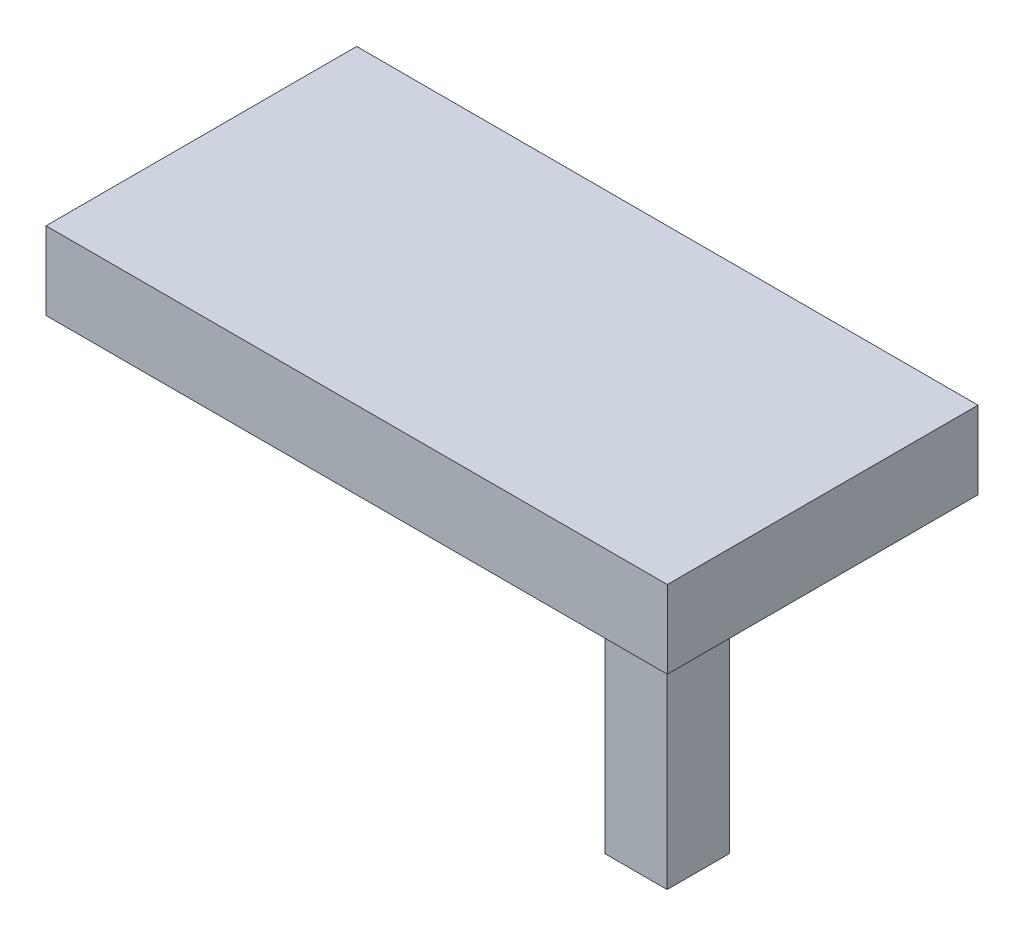
ISO-10303-21;
HEADER;
FILE_DESCRIPTION(('STEP AP214'),'2;1');
FILE_NAME('part.step','',(''),(''),'','','');
FILE_SCHEMA(('AUTOMOTIVE_DESIGN { 1 0 10303 214 1 1 1 1 }'));
ENDSEC;
DATA;
#1=APPLICATION_CONTEXT('core data for automotive mechanical design processes');
#2=APPLICATION_PROTOCOL_DEFINITION('international standard','automotive_design',2000,#1);
#3=PRODUCT_CONTEXT('',#1,'mechanical');
#4=PRODUCT('Part','Part','',(#3));
#5=PRODUCT_RELATED_PRODUCT_CATEGORY('part','',(#4));
#6=PRODUCT_DEFINITION_FORMATION('','',#4);
#7=PRODUCT_DEFINITION_CONTEXT('part definition',#1,'design');
#8=PRODUCT_DEFINITION('design','',#6,#7);
#9=PRODUCT_DEFINITION_SHAPE('','',#8);
#10=(LENGTH_UNIT() NAMED_UNIT(*) SI_UNIT(.MILLI.,.METRE.));
#11=(NAMED_UNIT(*) PLANE_ANGLE_UNIT() SI_UNIT($,.RADIAN.));
#12=(NAMED_UNIT(*) SI_UNIT($,.STERADIAN.) SOLID_ANGLE_UNIT());
#13=UNCERTAINTY_MEASURE_WITH_UNIT(LENGTH_MEASURE(1.E-05),#10,'distance_accuracy_value','');
#14=(GEOMETRIC_REPRESENTATION_CONTEXT(3) GLOBAL_UNCERTAINTY_ASSIGNED_CONTEXT((#13)) GLOBAL_UNIT_ASSIGNED_CONTEXT((#10,
#11,#12)) REPRESENTATION_CONTEXT('',''));
#15=CARTESIAN_POINT('',(0.,0.,0.));
#16=DIRECTION('',(0.,0.,1.));
#17=DIRECTION('',(1.,0.,0.));
#18=AXIS2_PLACEMENT_3D('',#15,#16,#17);
#19=CARTESIAN_POINT('',(0.,-100.,0.));
#20=DIRECTION('',(0.,-1.,0.));
#21=DIRECTION('',(0.,0.,-1.));
#22=AXIS2_PLACEMENT_3D('',#19,#20,#21);
#23=PLANE('',#22);
#24=DIRECTION('',(0.,0.,1.));
#25=VECTOR('',#24,1.);
#26=CARTESIAN_POINT('',(750.,-100.,251.580834492202));
#27=LINE('',#26,#25);
#28=CARTESIAN_POINT('',(750.,-100.,-251.580834492202));
#29=VERTEX_POINT('',#28);
#30=CARTESIAN_POINT('',(750.,-100.,251.580834492202));
#31=VERTEX_POINT('',#30);
#32=EDGE_CURVE('E183',#29,#31,#27,.T.);
#33=ORIENTED_EDGE('',*,*,#32,.T.);
#34=DIRECTION('',(-1.,0.,0.));
#35=VECTOR('',#34,1.);
#36=CARTESIAN_POINT('',(250.,-100.,251.580834492202));
#37=LINE('',#36,#35);
#38=CARTESIAN_POINT('',(250.,-100.,251.580834492202));
#39=VERTEX_POINT('',#38);
#40=EDGE_CURVE('E186',#31,#39,#37,.T.);
#41=ORIENTED_EDGE('',*,*,#40,.T.);
#42=DIRECTION('',(0.,0.,-1.));
#43=VECTOR('',#42,1.);
#44=CARTESIAN_POINT('',(250.,-100.,251.580834492202));
#45=LINE('',#44,#43);
#46=CARTESIAN_POINT('',(250.,-100.,-251.580834492202));
#47=VERTEX_POINT('',#46);
#48=EDGE_CURVE('E189',#39,#47,#45,.T.);
#49=ORIENTED_EDGE('',*,*,#48,.T.);
#50=DIRECTION('',(1.,0.,0.));
#51=VECTOR('',#50,1.);
#52=CARTESIAN_POINT('',(250.,-100.,-251.580834492202));
#53=LINE('',#52,#51);
#54=EDGE_CURVE('E191',#47,#29,#53,.T.);
#55=ORIENTED_EDGE('',*,*,#54,.T.);
#56=EDGE_LOOP('',(#33,#41,#49,#55));
#57=FACE_BOUND('',#56,.T.);
#58=DIRECTION('',(0.,0.,1.));
#59=VECTOR('',#58,1.);
#60=CARTESIAN_POINT('',(600.,-100.,-100.632333796881));
#61=LINE('',#60,#59);
#62=CARTESIAN_POINT('',(600.,-100.,-100.632333796881));
#63=VERTEX_POINT('',#62);
#64=CARTESIAN_POINT('',(600.,-100.,100.632333796881));
#65=VERTEX_POINT('',#64);
#66=EDGE_CURVE('E165',#63,#65,#61,.T.);
#67=ORIENTED_EDGE('',*,*,#66,.F.);
#68=DIRECTION('',(-1.,0.,0.));
#69=VECTOR('',#68,1.);
#70=CARTESIAN_POINT('',(600.,-100.,-100.632333796881));
#71=LINE('',#70,#69);
#72=CARTESIAN_POINT('',(400.,-100.,-100.632333796881));
#73=VERTEX_POINT('',#72);
#74=EDGE_CURVE('E48',#63,#73,#71,.T.);
#75=ORIENTED_EDGE('',*,*,#74,.T.);
#76=DIRECTION('',(0.,0.,1.));
#77=VECTOR('',#76,1.);
#78=CARTESIAN_POINT('',(400.,-100.,-100.632333796881));
#79=LINE('',#78,#77);
#80=CARTESIAN_POINT('',(400.,-100.,100.632333796881));
#81=VERTEX_POINT('',#80);
#82=EDGE_CURVE('E53',#73,#81,#79,.T.);
#83=ORIENTED_EDGE('',*,*,#82,.T.);
#84=DIRECTION('',(-1.,0.,0.));
#85=VECTOR('',#84,1.);
#86=CARTESIAN_POINT('',(600.,-100.,100.632333796881));
#87=LINE('',#86,#85);
#88=EDGE_CURVE('E168',#65,#81,#87,.T.);
#89=ORIENTED_EDGE('',*,*,#88,.F.);
#90=EDGE_LOOP('',(#67,#75,#83,#89));
#91=FACE_BOUND('',#90,.T.);
#92=ADVANCED_FACE('F33',(#57,#91),#23,.T.);
#93=CARTESIAN_POINT('',(0.,0.,0.));
#94=DIRECTION('',(0.,1.,0.));
#95=DIRECTION('',(0.,0.,1.));
#96=AXIS2_PLACEMENT_3D('',#93,#94,#95);
#97=PLANE('',#96);
#98=DIRECTION('',(0.,0.,-1.));
#99=VECTOR('',#98,1.);
#100=CARTESIAN_POINT('',(-750.,0.,-251.580834492202));
#101=LINE('',#100,#99);
#102=CARTESIAN_POINT('',(-750.,0.,251.580834492202));
#103=VERTEX_POINT('',#102);
#104=CARTESIAN_POINT('',(-750.,0.,-251.580834492202));
#105=VERTEX_POINT('',#104);
#106=EDGE_CURVE('E215',#103,#105,#101,.T.);
#107=ORIENTED_EDGE('',*,*,#106,.F.);
#108=DIRECTION('',(-1.,0.,0.));
#109=VECTOR('',#108,1.);
#110=CARTESIAN_POINT('',(-250.,0.,251.580834492202));
#111=LINE('',#110,#109);
#112=CARTESIAN_POINT('',(-250.,0.,251.580834492202));
#113=VERTEX_POINT('',#112);
#114=EDGE_CURVE('E220',#113,#103,#111,.T.);
#115=ORIENTED_EDGE('',*,*,#114,.F.);
#116=DIRECTION('',(0.,0.,1.));
#117=VECTOR('',#116,1.);
#118=CARTESIAN_POINT('',(-250.,0.,-251.580834492202));
#119=LINE('',#118,#117);
#120=CARTESIAN_POINT('',(-250.,0.,-251.580834492202));
#121=VERTEX_POINT('',#120);
#122=EDGE_CURVE('E232',#121,#113,#119,.T.);
#123=ORIENTED_EDGE('',*,*,#122,.F.);
#124=DIRECTION('',(1.,0.,0.));
#125=VECTOR('',#124,1.);
#126=CARTESIAN_POINT('',(-250.,0.,-251.580834492202));
#127=LINE('',#126,#125);
#128=EDGE_CURVE('E229',#105,#121,#127,.T.);
#129=ORIENTED_EDGE('',*,*,#128,.F.);
#130=EDGE_LOOP('',(#107,#115,#123,#129));
#131=FACE_BOUND('',#130,.T.);
#132=DIRECTION('',(0.,0.,-1.));
#133=VECTOR('',#132,1.);
#134=CARTESIAN_POINT('',(1000.,0.,-500.));
#135=LINE('',#134,#133);
#136=CARTESIAN_POINT('',(1000.,0.,500.));
#137=VERTEX_POINT('',#136);
#138=CARTESIAN_POINT('',(1000.,0.,-500.));
#139=VERTEX_POINT('',#138);
#140=EDGE_CURVE('E248',#137,#139,#135,.T.);
#141=ORIENTED_EDGE('',*,*,#140,.F.);
#142=DIRECTION('',(1.,0.,0.));
#143=VECTOR('',#142,1.);
#144=CARTESIAN_POINT('',(-1000.,0.,500.));
#145=LINE('',#144,#143);
#146=CARTESIAN_POINT('',(-1000.,0.,500.));
#147=VERTEX_POINT('',#146);
#148=EDGE_CURVE('E253',#147,#137,#145,.T.);
#149=ORIENTED_EDGE('',*,*,#148,.F.);
#150=DIRECTION('',(0.,0.,1.));
#151=VECTOR('',#150,1.);
#152=CARTESIAN_POINT('',(-1000.,0.,-500.));
#153=LINE('',#152,#151);
#154=CARTESIAN_POINT('',(-1000.,0.,-500.));
#155=VERTEX_POINT('',#154);
#156=EDGE_CURVE('E264',#155,#147,#153,.T.);
#157=ORIENTED_EDGE('',*,*,#156,.F.);
#158=DIRECTION('',(-1.,0.,0.));
#159=VECTOR('',#158,1.);
#160=CARTESIAN_POINT('',(-1000.,0.,-500.));
#161=LINE('',#160,#159);
#162=EDGE_CURVE('E262',#139,#155,#161,.T.);
#163=ORIENTED_EDGE('',*,*,#162,.F.);
#164=EDGE_LOOP('',(#141,#149,#157,#163));
#165=FACE_BOUND('',#164,.T.);
#166=DIRECTION('',(0.,0.,1.));
#167=VECTOR('',#166,1.);
#168=CARTESIAN_POINT('',(750.,0.,251.580834492202));
#169=LINE('',#168,#167);
#170=CARTESIAN_POINT('',(750.,0.,-251.580834492202));
#171=VERTEX_POINT('',#170);
#172=CARTESIAN_POINT('',(750.,0.,251.580834492202));
#173=VERTEX_POINT('',#172);
#174=EDGE_CURVE('E178',#171,#173,#169,.T.);
#175=ORIENTED_EDGE('',*,*,#174,.F.);
#176=DIRECTION('',(1.,0.,0.));
#177=VECTOR('',#176,1.);
#178=CARTESIAN_POINT('',(250.,0.,-251.580834492202));
#179=LINE('',#178,#177);
#180=CARTESIAN_POINT('',(250.,0.,-251.580834492202));
#181=VERTEX_POINT('',#180);
#182=EDGE_CURVE('E187',#181,#171,#179,.T.);
#183=ORIENTED_EDGE('',*,*,#182,.F.);
#184=DIRECTION('',(0.,0.,-1.));
#185=VECTOR('',#184,1.);
#186=CARTESIAN_POINT('',(250.,0.,251.580834492202));
#187=LINE('',#186,#185);
#188=CARTESIAN_POINT('',(250.,0.,251.580834492202));
#189=VERTEX_POINT('',#188);
#190=EDGE_CURVE('E199',#189,#181,#187,.T.);
#191=ORIENTED_EDGE('',*,*,#190,.F.);
#192=DIRECTION('',(-1.,0.,0.));
#193=VECTOR('',#192,1.);
#194=CARTESIAN_POINT('',(250.,0.,251.580834492202));
#195=LINE('',#194,#193);
#196=EDGE_CURVE('E196',#173,#189,#195,.T.);
#197=ORIENTED_EDGE('',*,*,#196,.F.);
#198=EDGE_LOOP('',(#175,#183,#191,#197));
#199=FACE_BOUND('',#198,.T.);
#200=ADVANCED_FACE('F282',(#131,#165,#199),#97,.F.);
#201=CARTESIAN_POINT('',(1000.,250.,-500.));
#202=DIRECTION('',(-1.,0.,0.));
#203=DIRECTION('',(0.,0.,1.));
#204=AXIS2_PLACEMENT_3D('',#201,#202,#203);
#205=PLANE('',#204);
#206=ORIENTED_EDGE('',*,*,#140,.T.);
#207=DIRECTION('',(0.,-1.,0.));
#208=VECTOR('',#207,1.);
#209=CARTESIAN_POINT('',(1000.,250.,-500.));
#210=LINE('',#209,#208);
#211=CARTESIAN_POINT('',(1000.,250.,-500.));
#212=VERTEX_POINT('',#211);
#213=EDGE_CURVE('E11',#212,#139,#210,.T.);
#214=ORIENTED_EDGE('',*,*,#213,.F.);
#215=DIRECTION('',(0.,0.,-1.));
#216=VECTOR('',#215,1.);
#217=CARTESIAN_POINT('',(1000.,250.,-500.));
#218=LINE('',#217,#216);
#219=CARTESIAN_POINT('',(1000.,250.,500.));
#220=VERTEX_POINT('',#219);
#221=EDGE_CURVE('E249',#220,#212,#218,.T.);
#222=ORIENTED_EDGE('',*,*,#221,.F.);
#223=DIRECTION('',(0.,-1.,0.));
#224=VECTOR('',#223,1.);
#225=CARTESIAN_POINT('',(1000.,250.,500.));
#226=LINE('',#225,#224);
#227=EDGE_CURVE('E259',#220,#137,#226,.T.);
#228=ORIENTED_EDGE('',*,*,#227,.T.);
#229=EDGE_LOOP('',(#206,#214,#222,#228));
#230=FACE_BOUND('',#229,.T.);
#231=ADVANCED_FACE('F35',(#230),#205,.F.);
#232=CARTESIAN_POINT('',(-1000.,250.,-500.));
#233=DIRECTION('',(0.,0.,1.));
#234=DIRECTION('',(1.,0.,0.));
#235=AXIS2_PLACEMENT_3D('',#232,#233,#234);
#236=PLANE('',#235);
#237=ORIENTED_EDGE('',*,*,#162,.T.);
#238=DIRECTION('',(0.,-1.,0.));
#239=VECTOR('',#238,1.);
#240=CARTESIAN_POINT('',(-1000.,250.,-500.));
#241=LINE('',#240,#239);
#242=CARTESIAN_POINT('',(-1000.,250.,-500.));
#243=VERTEX_POINT('',#242);
#244=EDGE_CURVE('E41',#243,#155,#241,.T.);
#245=ORIENTED_EDGE('',*,*,#244,.F.);
#246=DIRECTION('',(-1.,0.,0.));
#247=VECTOR('',#246,1.);
#248=CARTESIAN_POINT('',(-1000.,250.,-500.));
#249=LINE('',#248,#247);
#250=EDGE_CURVE('E252',#212,#243,#249,.T.);
#251=ORIENTED_EDGE('',*,*,#250,.F.);
#252=ORIENTED_EDGE('',*,*,#213,.T.);
#253=EDGE_LOOP('',(#237,#245,#251,#252));
#254=FACE_BOUND('',#253,.T.);
#255=ADVANCED_FACE('F293',(#254),#236,.F.);
#256=CARTESIAN_POINT('',(-1000.,250.,-500.));
#257=DIRECTION('',(1.,0.,0.));
#258=DIRECTION('',(0.,0.,-1.));
#259=AXIS2_PLACEMENT_3D('',#256,#257,#258);
#260=PLANE('',#259);
#261=ORIENTED_EDGE('',*,*,#156,.T.);
#262=DIRECTION('',(0.,-1.,0.));
#263=VECTOR('',#262,1.);
#264=CARTESIAN_POINT('',(-1000.,250.,500.));
#265=LINE('',#264,#263);
#266=CARTESIAN_POINT('',(-1000.,250.,500.));
#267=VERTEX_POINT('',#266);
#268=EDGE_CURVE('E269',#267,#147,#265,.T.);
#269=ORIENTED_EDGE('',*,*,#268,.F.);
#270=DIRECTION('',(0.,0.,1.));
#271=VECTOR('',#270,1.);
#272=CARTESIAN_POINT('',(-1000.,250.,-500.));
#273=LINE('',#272,#271);
#274=EDGE_CURVE('E255',#243,#267,#273,.T.);
#275=ORIENTED_EDGE('',*,*,#274,.F.);
#276=ORIENTED_EDGE('',*,*,#244,.T.);
#277=EDGE_LOOP('',(#261,#269,#275,#276));
#278=FACE_BOUND('',#277,.T.);
#279=ADVANCED_FACE('F276',(#278),#260,.F.);
#280=CARTESIAN_POINT('',(-1000.,250.,500.));
#281=DIRECTION('',(0.,0.,-1.));
#282=DIRECTION('',(-1.,0.,0.));
#283=AXIS2_PLACEMENT_3D('',#280,#281,#282);
#284=PLANE('',#283);
#285=ORIENTED_EDGE('',*,*,#148,.T.);
#286=ORIENTED_EDGE('',*,*,#227,.F.);
#287=DIRECTION('',(1.,0.,0.));
#288=VECTOR('',#287,1.);
#289=CARTESIAN_POINT('',(-1000.,250.,500.));
#290=LINE('',#289,#288);
#291=EDGE_CURVE('E257',#267,#220,#290,.T.);
#292=ORIENTED_EDGE('',*,*,#291,.F.);
#293=ORIENTED_EDGE('',*,*,#268,.T.);
#294=EDGE_LOOP('',(#285,#286,#292,#293));
#295=FACE_BOUND('',#294,.T.);
#296=ADVANCED_FACE('F286',(#295),#284,.F.);
#297=CARTESIAN_POINT('',(0.,250.,0.));
#298=DIRECTION('',(0.,1.,0.));
#299=DIRECTION('',(0.,0.,1.));
#300=AXIS2_PLACEMENT_3D('',#297,#298,#299);
#301=PLANE('',#300);
#302=ORIENTED_EDGE('',*,*,#221,.T.);
#303=ORIENTED_EDGE('',*,*,#250,.T.);
#304=ORIENTED_EDGE('',*,*,#274,.T.);
#305=ORIENTED_EDGE('',*,*,#291,.T.);
#306=EDGE_LOOP('',(#302,#303,#304,#305));
#307=FACE_BOUND('',#306,.T.);
#308=ADVANCED_FACE('F292',(#307),#301,.T.);
#309=CARTESIAN_POINT('',(-750.,-100.,-251.580834492202));
#310=DIRECTION('',(1.,0.,0.));
#311=DIRECTION('',(0.,0.,-1.));
#312=AXIS2_PLACEMENT_3D('',#309,#310,#311);
#313=PLANE('',#312);
#314=ORIENTED_EDGE('',*,*,#106,.T.);
#315=DIRECTION('',(0.,1.,0.));
#316=VECTOR('',#315,1.);
#317=CARTESIAN_POINT('',(-750.,-100.,-251.580834492202));
#318=LINE('',#317,#316);
#319=CARTESIAN_POINT('',(-750.,-100.,-251.580834492202));
#320=VERTEX_POINT('',#319);
#321=EDGE_CURVE('E245',#320,#105,#318,.T.);
#322=ORIENTED_EDGE('',*,*,#321,.F.);
#323=DIRECTION('',(0.,0.,-1.));
#324=VECTOR('',#323,1.);
#325=CARTESIAN_POINT('',(-750.,-100.,-251.580834492202));
#326=LINE('',#325,#324);
#327=CARTESIAN_POINT('',(-750.,-100.,251.580834492202));
#328=VERTEX_POINT('',#327);
#329=EDGE_CURVE('E216',#328,#320,#326,.T.);
#330=ORIENTED_EDGE('',*,*,#329,.F.);
#331=DIRECTION('',(0.,1.,0.));
#332=VECTOR('',#331,1.);
#333=CARTESIAN_POINT('',(-750.,-100.,251.580834492202));
#334=LINE('',#333,#332);
#335=EDGE_CURVE('E226',#328,#103,#334,.T.);
#336=ORIENTED_EDGE('',*,*,#335,.T.);
#337=EDGE_LOOP('',(#314,#322,#330,#336));
#338=FACE_BOUND('',#337,.T.);
#339=ADVANCED_FACE('F342',(#338),#313,.F.);
#340=CARTESIAN_POINT('',(-250.,-100.,-251.580834492202));
#341=DIRECTION('',(0.,0.,1.));
#342=DIRECTION('',(1.,0.,0.));
#343=AXIS2_PLACEMENT_3D('',#340,#341,#342);
#344=PLANE('',#343);
#345=ORIENTED_EDGE('',*,*,#128,.T.);
#346=DIRECTION('',(0.,1.,0.));
#347=VECTOR('',#346,1.);
#348=CARTESIAN_POINT('',(-250.,-100.,-251.580834492202));
#349=LINE('',#348,#347);
#350=CARTESIAN_POINT('',(-250.,-100.,-251.580834492202));
#351=VERTEX_POINT('',#350);
#352=EDGE_CURVE('E242',#351,#121,#349,.T.);
#353=ORIENTED_EDGE('',*,*,#352,.F.);
#354=DIRECTION('',(1.,0.,0.));
#355=VECTOR('',#354,1.);
#356=CARTESIAN_POINT('',(-250.,-100.,-251.580834492202));
#357=LINE('',#356,#355);
#358=EDGE_CURVE('E219',#320,#351,#357,.T.);
#359=ORIENTED_EDGE('',*,*,#358,.F.);
#360=ORIENTED_EDGE('',*,*,#321,.T.);
#361=EDGE_LOOP('',(#345,#353,#359,#360));
#362=FACE_BOUND('',#361,.T.);
#363=ADVANCED_FACE('F338',(#362),#344,.F.);
#364=CARTESIAN_POINT('',(-250.,-100.,-251.580834492202));
#365=DIRECTION('',(-1.,0.,0.));
#366=DIRECTION('',(0.,0.,1.));
#367=AXIS2_PLACEMENT_3D('',#364,#365,#366);
#368=PLANE('',#367);
#369=ORIENTED_EDGE('',*,*,#122,.T.);
#370=DIRECTION('',(0.,1.,0.));
#371=VECTOR('',#370,1.);
#372=CARTESIAN_POINT('',(-250.,-100.,251.580834492202));
#373=LINE('',#372,#371);
#374=CARTESIAN_POINT('',(-250.,-100.,251.580834492202));
#375=VERTEX_POINT('',#374);
#376=EDGE_CURVE('E239',#375,#113,#373,.T.);
#377=ORIENTED_EDGE('',*,*,#376,.F.);
#378=DIRECTION('',(0.,0.,1.));
#379=VECTOR('',#378,1.);
#380=CARTESIAN_POINT('',(-250.,-100.,-251.580834492202));
#381=LINE('',#380,#379);
#382=EDGE_CURVE('E222',#351,#375,#381,.T.);
#383=ORIENTED_EDGE('',*,*,#382,.F.);
#384=ORIENTED_EDGE('',*,*,#352,.T.);
#385=EDGE_LOOP('',(#369,#377,#383,#384));
#386=FACE_BOUND('',#385,.T.);
#387=ADVANCED_FACE('F334',(#386),#368,.F.);
#388=CARTESIAN_POINT('',(-250.,-100.,251.580834492202));
#389=DIRECTION('',(0.,0.,-1.));
#390=DIRECTION('',(-1.,0.,0.));
#391=AXIS2_PLACEMENT_3D('',#388,#389,#390);
#392=PLANE('',#391);
#393=ORIENTED_EDGE('',*,*,#114,.T.);
#394=ORIENTED_EDGE('',*,*,#335,.F.);
#395=DIRECTION('',(-1.,0.,0.));
#396=VECTOR('',#395,1.);
#397=CARTESIAN_POINT('',(-250.,-100.,251.580834492202));
#398=LINE('',#397,#396);
#399=EDGE_CURVE('E224',#375,#328,#398,.T.);
#400=ORIENTED_EDGE('',*,*,#399,.F.);
#401=ORIENTED_EDGE('',*,*,#376,.T.);
#402=EDGE_LOOP('',(#393,#394,#400,#401));
#403=FACE_BOUND('',#402,.T.);
#404=ADVANCED_FACE('F330',(#403),#392,.F.);
#405=CARTESIAN_POINT('',(0.,-100.,0.));
#406=DIRECTION('',(0.,-1.,0.));
#407=DIRECTION('',(0.,0.,-1.));
#408=AXIS2_PLACEMENT_3D('',#405,#406,#407);
#409=PLANE('',#408);
#410=ORIENTED_EDGE('',*,*,#329,.T.);
#411=ORIENTED_EDGE('',*,*,#358,.T.);
#412=ORIENTED_EDGE('',*,*,#382,.T.);
#413=ORIENTED_EDGE('',*,*,#399,.T.);
#414=EDGE_LOOP('',(#410,#411,#412,#413));
#415=FACE_BOUND('',#414,.T.);
#416=ADVANCED_FACE('F326',(#415),#409,.T.);
#417=CARTESIAN_POINT('',(750.,-100.,251.580834492202));
#418=DIRECTION('',(-1.,0.,0.));
#419=DIRECTION('',(0.,0.,1.));
#420=AXIS2_PLACEMENT_3D('',#417,#418,#419);
#421=PLANE('',#420);
#422=ORIENTED_EDGE('',*,*,#174,.T.);
#423=DIRECTION('',(0.,1.,0.));
#424=VECTOR('',#423,1.);
#425=CARTESIAN_POINT('',(750.,-100.,251.580834492202));
#426=LINE('',#425,#424);
#427=EDGE_CURVE('E212',#31,#173,#426,.T.);
#428=ORIENTED_EDGE('',*,*,#427,.F.);
#429=ORIENTED_EDGE('',*,*,#32,.F.);
#430=DIRECTION('',(0.,1.,0.));
#431=VECTOR('',#430,1.);
#432=CARTESIAN_POINT('',(750.,-100.,-251.580834492202));
#433=LINE('',#432,#431);
#434=EDGE_CURVE('E193',#29,#171,#433,.T.);
#435=ORIENTED_EDGE('',*,*,#434,.T.);
#436=EDGE_LOOP('',(#422,#428,#429,#435));
#437=FACE_BOUND('',#436,.T.);
#438=ADVANCED_FACE('F322',(#437),#421,.F.);
#439=CARTESIAN_POINT('',(250.,-100.,251.580834492202));
#440=DIRECTION('',(0.,0.,-1.));
#441=DIRECTION('',(-1.,0.,0.));
#442=AXIS2_PLACEMENT_3D('',#439,#440,#441);
#443=PLANE('',#442);
#444=ORIENTED_EDGE('',*,*,#196,.T.);
#445=DIRECTION('',(0.,1.,0.));
#446=VECTOR('',#445,1.);
#447=CARTESIAN_POINT('',(250.,-100.,251.580834492202));
#448=LINE('',#447,#446);
#449=EDGE_CURVE('E209',#39,#189,#448,.T.);
#450=ORIENTED_EDGE('',*,*,#449,.F.);
#451=ORIENTED_EDGE('',*,*,#40,.F.);
#452=ORIENTED_EDGE('',*,*,#427,.T.);
#453=EDGE_LOOP('',(#444,#450,#451,#452));
#454=FACE_BOUND('',#453,.T.);
#455=ADVANCED_FACE('F318',(#454),#443,.F.);
#456=CARTESIAN_POINT('',(250.,-100.,251.580834492202));
#457=DIRECTION('',(1.,0.,0.));
#458=DIRECTION('',(0.,0.,-1.));
#459=AXIS2_PLACEMENT_3D('',#456,#457,#458);
#460=PLANE('',#459);
#461=ORIENTED_EDGE('',*,*,#190,.T.);
#462=DIRECTION('',(0.,1.,0.));
#463=VECTOR('',#462,1.);
#464=CARTESIAN_POINT('',(250.,-100.,-251.580834492202));
#465=LINE('',#464,#463);
#466=EDGE_CURVE('E206',#47,#181,#465,.T.);
#467=ORIENTED_EDGE('',*,*,#466,.F.);
#468=ORIENTED_EDGE('',*,*,#48,.F.);
#469=ORIENTED_EDGE('',*,*,#449,.T.);
#470=EDGE_LOOP('',(#461,#467,#468,#469));
#471=FACE_BOUND('',#470,.T.);
#472=ADVANCED_FACE('F314',(#471),#460,.F.);
#473=CARTESIAN_POINT('',(250.,-100.,-251.580834492202));
#474=DIRECTION('',(0.,0.,1.));
#475=DIRECTION('',(1.,0.,0.));
#476=AXIS2_PLACEMENT_3D('',#473,#474,#475);
#477=PLANE('',#476);
#478=ORIENTED_EDGE('',*,*,#182,.T.);
#479=ORIENTED_EDGE('',*,*,#434,.F.);
#480=ORIENTED_EDGE('',*,*,#54,.F.);
#481=ORIENTED_EDGE('',*,*,#466,.T.);
#482=EDGE_LOOP('',(#478,#479,#480,#481));
#483=FACE_BOUND('',#482,.T.);
#484=ADVANCED_FACE('F311',(#483),#477,.F.);
#485=CARTESIAN_POINT('',(600.,-1000.,-100.632333796881));
#486=DIRECTION('',(0.,0.,-1.));
#487=DIRECTION('',(-1.,0.,0.));
#488=AXIS2_PLACEMENT_3D('',#485,#486,#487);
#489=PLANE('',#488);
#490=ORIENTED_EDGE('',*,*,#74,.F.);
#491=DIRECTION('',(0.,1.,0.));
#492=VECTOR('',#491,1.);
#493=CARTESIAN_POINT('',(600.,-1000.,-100.632333796881));
#494=LINE('',#493,#492);
#495=CARTESIAN_POINT('',(600.,-1000.,-100.632333796881));
#496=VERTEX_POINT('',#495);
#497=EDGE_CURVE('E163',#496,#63,#494,.T.);
#498=ORIENTED_EDGE('',*,*,#497,.F.);
#499=DIRECTION('',(-1.,0.,0.));
#500=VECTOR('',#499,1.);
#501=CARTESIAN_POINT('',(600.,-1000.,-100.632333796881));
#502=LINE('',#501,#500);
#503=CARTESIAN_POINT('',(400.,-1000.,-100.632333796881));
#504=VERTEX_POINT('',#503);
#505=EDGE_CURVE('E156',#496,#504,#502,.T.);
#506=ORIENTED_EDGE('',*,*,#505,.T.);
#507=DIRECTION('',(0.,1.,0.));
#508=VECTOR('',#507,1.);
#509=CARTESIAN_POINT('',(400.,-1000.,-100.632333796881));
#510=LINE('',#509,#508);
#511=EDGE_CURVE('E144',#504,#73,#510,.T.);
#512=ORIENTED_EDGE('',*,*,#511,.T.);
#513=EDGE_LOOP('',(#490,#498,#506,#512));
#514=FACE_BOUND('',#513,.T.);
#515=ADVANCED_FACE('F161',(#514),#489,.T.);
#516=CARTESIAN_POINT('',(600.,-1000.,-100.632333796881));
#517=DIRECTION('',(-1.,0.,0.));
#518=DIRECTION('',(0.,0.,1.));
#519=AXIS2_PLACEMENT_3D('',#516,#517,#518);
#520=PLANE('',#519);
#521=ORIENTED_EDGE('',*,*,#66,.T.);
#522=DIRECTION('',(0.,1.,0.));
#523=VECTOR('',#522,1.);
#524=CARTESIAN_POINT('',(600.,-1000.,100.632333796881));
#525=LINE('',#524,#523);
#526=CARTESIAN_POINT('',(600.,-1000.,100.632333796881));
#527=VERTEX_POINT('',#526);
#528=EDGE_CURVE('E179',#527,#65,#525,.T.);
#529=ORIENTED_EDGE('',*,*,#528,.F.);
#530=DIRECTION('',(0.,0.,1.));
#531=VECTOR('',#530,1.);
#532=CARTESIAN_POINT('',(600.,-1000.,-100.632333796881));
#533=LINE('',#532,#531);
#534=EDGE_CURVE('E151',#496,#527,#533,.T.);
#535=ORIENTED_EDGE('',*,*,#534,.F.);
#536=ORIENTED_EDGE('',*,*,#497,.T.);
#537=EDGE_LOOP('',(#521,#529,#535,#536));
#538=FACE_BOUND('',#537,.T.);
#539=ADVANCED_FACE('F401',(#538),#520,.F.);
#540=CARTESIAN_POINT('',(600.,-1000.,100.632333796881));
#541=DIRECTION('',(0.,0.,-1.));
#542=DIRECTION('',(-1.,0.,0.));
#543=AXIS2_PLACEMENT_3D('',#540,#541,#542);
#544=PLANE('',#543);
#545=ORIENTED_EDGE('',*,*,#88,.T.);
#546=DIRECTION('',(0.,1.,0.));
#547=VECTOR('',#546,1.);
#548=CARTESIAN_POINT('',(400.,-1000.,100.632333796881));
#549=LINE('',#548,#547);
#550=CARTESIAN_POINT('',(400.,-1000.,100.632333796881));
#551=VERTEX_POINT('',#550);
#552=EDGE_CURVE('E150',#551,#81,#549,.T.);
#553=ORIENTED_EDGE('',*,*,#552,.F.);
#554=DIRECTION('',(-1.,0.,0.));
#555=VECTOR('',#554,1.);
#556=CARTESIAN_POINT('',(600.,-1000.,100.632333796881));
#557=LINE('',#556,#555);
#558=EDGE_CURVE('E158',#527,#551,#557,.T.);
#559=ORIENTED_EDGE('',*,*,#558,.F.);
#560=ORIENTED_EDGE('',*,*,#528,.T.);
#561=EDGE_LOOP('',(#545,#553,#559,#560));
#562=FACE_BOUND('',#561,.T.);
#563=ADVANCED_FACE('F407',(#562),#544,.F.);
#564=CARTESIAN_POINT('',(400.,-1000.,-100.632333796881));
#565=DIRECTION('',(-1.,0.,0.));
#566=DIRECTION('',(0.,0.,1.));
#567=AXIS2_PLACEMENT_3D('',#564,#565,#566);
#568=PLANE('',#567);
#569=ORIENTED_EDGE('',*,*,#82,.F.);
#570=ORIENTED_EDGE('',*,*,#511,.F.);
#571=DIRECTION('',(0.,0.,1.));
#572=VECTOR('',#571,1.);
#573=CARTESIAN_POINT('',(400.,-1000.,-100.632333796881));
#574=LINE('',#573,#572);
#575=EDGE_CURVE('E147',#504,#551,#574,.T.);
#576=ORIENTED_EDGE('',*,*,#575,.T.);
#577=ORIENTED_EDGE('',*,*,#552,.T.);
#578=EDGE_LOOP('',(#569,#570,#576,#577));
#579=FACE_BOUND('',#578,.T.);
#580=ADVANCED_FACE('F146',(#579),#568,.T.);
#581=CARTESIAN_POINT('',(0.,-1000.,0.));
#582=DIRECTION('',(0.,1.,0.));
#583=DIRECTION('',(0.,0.,1.));
#584=AXIS2_PLACEMENT_3D('',#581,#582,#583);
#585=PLANE('',#584);
#586=ORIENTED_EDGE('',*,*,#505,.F.);
#587=ORIENTED_EDGE('',*,*,#534,.T.);
#588=ORIENTED_EDGE('',*,*,#558,.T.);
#589=ORIENTED_EDGE('',*,*,#575,.F.);
#590=EDGE_LOOP('',(#586,#587,#588,#589));
#591=FACE_BOUND('',#590,.T.);
#592=ADVANCED_FACE('F155',(#591),#585,.F.);
#593=CLOSED_SHELL('',(#92,#200,#231,#255,#279,#296,#308,#339,#363,#387,#404,#416,#438,#455,#472,
#484,#515,#539,#563,#580,#592));
#594=MANIFOLD_SOLID_BREP('B2',#593);
#595=ADVANCED_BREP_SHAPE_REPRESENTATION('',(#18,#594),#14);
#596=SHAPE_DEFINITION_REPRESENTATION(#9,#595);
ENDSEC;
END-ISO-10303-21;
